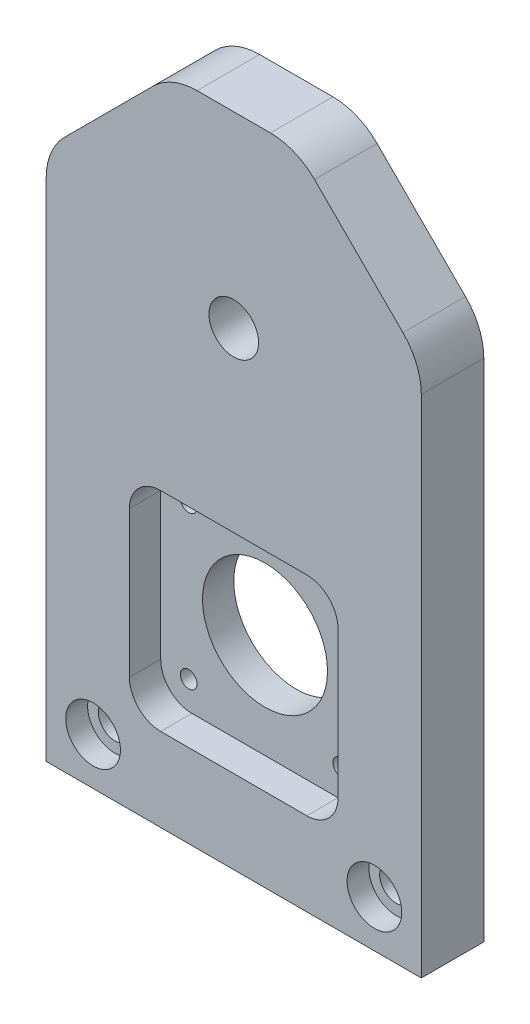
ISO-10303-21;
HEADER;
FILE_DESCRIPTION(('STEP AP214'),'2;1');
FILE_NAME('part.step','',(''),(''),'','','');
FILE_SCHEMA(('AUTOMOTIVE_DESIGN { 1 0 10303 214 1 1 1 1 }'));
ENDSEC;
DATA;
#1=APPLICATION_CONTEXT('core data for automotive mechanical design processes');
#2=APPLICATION_PROTOCOL_DEFINITION('international standard','automotive_design',2000,#1);
#3=PRODUCT_CONTEXT('',#1,'mechanical');
#4=PRODUCT('Part','Part','',(#3));
#5=PRODUCT_RELATED_PRODUCT_CATEGORY('part','',(#4));
#6=PRODUCT_DEFINITION_FORMATION('','',#4);
#7=PRODUCT_DEFINITION_CONTEXT('part definition',#1,'design');
#8=PRODUCT_DEFINITION('design','',#6,#7);
#9=PRODUCT_DEFINITION_SHAPE('','',#8);
#10=(LENGTH_UNIT() NAMED_UNIT(*) SI_UNIT(.MILLI.,.METRE.));
#11=(NAMED_UNIT(*) PLANE_ANGLE_UNIT() SI_UNIT($,.RADIAN.));
#12=(NAMED_UNIT(*) SI_UNIT($,.STERADIAN.) SOLID_ANGLE_UNIT());
#13=UNCERTAINTY_MEASURE_WITH_UNIT(LENGTH_MEASURE(1.E-05),#10,'distance_accuracy_value','');
#14=(GEOMETRIC_REPRESENTATION_CONTEXT(3) GLOBAL_UNCERTAINTY_ASSIGNED_CONTEXT((#13)) GLOBAL_UNIT_ASSIGNED_CONTEXT((#10,
#11,#12)) REPRESENTATION_CONTEXT('',''));
#15=CARTESIAN_POINT('',(0.,0.,0.));
#16=DIRECTION('',(0.,0.,1.));
#17=DIRECTION('',(1.,0.,0.));
#18=AXIS2_PLACEMENT_3D('',#15,#16,#17);
#19=CARTESIAN_POINT('',(38.1,-95.25,6.35));
#20=DIRECTION('',(-1.,0.,0.));
#21=DIRECTION('',(0.,-1.,0.));
#22=AXIS2_PLACEMENT_3D('',#19,#20,#21);
#23=PLANE('',#22);
#24=DIRECTION('',(0.,1.,0.));
#25=VECTOR('',#24,1.);
#26=CARTESIAN_POINT('',(38.1,-95.25,-6.35));
#27=LINE('',#26,#25);
#28=CARTESIAN_POINT('',(38.1,-95.25,-6.35));
#29=VERTEX_POINT('',#28);
#30=CARTESIAN_POINT('',(38.1,7.4394877578616,-6.35));
#31=VERTEX_POINT('',#30);
#32=EDGE_CURVE('E202',#29,#31,#27,.T.);
#33=ORIENTED_EDGE('',*,*,#32,.T.);
#34=DIRECTION('',(0.,0.,-1.));
#35=VECTOR('',#34,1.);
#36=CARTESIAN_POINT('',(38.1,7.4394877578616,6.35));
#37=LINE('',#36,#35);
#38=CARTESIAN_POINT('',(38.1,7.4394877578616,6.35));
#39=VERTEX_POINT('',#38);
#40=EDGE_CURVE('E288',#31,#39,#37,.F.);
#41=ORIENTED_EDGE('',*,*,#40,.T.);
#42=DIRECTION('',(0.,1.,0.));
#43=VECTOR('',#42,1.);
#44=CARTESIAN_POINT('',(38.1,-95.25,6.35));
#45=LINE('',#44,#43);
#46=CARTESIAN_POINT('',(38.1,-95.25,6.35));
#47=VERTEX_POINT('',#46);
#48=EDGE_CURVE('E215',#47,#39,#45,.T.);
#49=ORIENTED_EDGE('',*,*,#48,.F.);
#50=DIRECTION('',(0.,0.,-1.));
#51=VECTOR('',#50,1.);
#52=CARTESIAN_POINT('',(38.1,-95.25,6.35));
#53=LINE('',#52,#51);
#54=EDGE_CURVE('E191',#47,#29,#53,.T.);
#55=ORIENTED_EDGE('',*,*,#54,.T.);
#56=EDGE_LOOP('',(#33,#41,#49,#55));
#57=FACE_BOUND('',#56,.T.);
#58=ADVANCED_FACE('F43',(#57),#23,.F.);
#59=CARTESIAN_POINT('',(-38.1,38.1,6.35));
#60=DIRECTION('',(0.,-1.,0.));
#61=DIRECTION('',(0.,0.,-1.));
#62=AXIS2_PLACEMENT_3D('',#59,#60,#61);
#63=PLANE('',#62);
#64=DIRECTION('',(-1.,0.,0.));
#65=VECTOR('',#64,1.);
#66=CARTESIAN_POINT('',(-38.1,38.1,6.35));
#67=LINE('',#66,#65);
#68=CARTESIAN_POINT('',(7.43948775786166,38.1,6.35));
#69=VERTEX_POINT('',#68);
#70=CARTESIAN_POINT('',(-7.4394877578616,38.1,6.35));
#71=VERTEX_POINT('',#70);
#72=EDGE_CURVE('E181',#69,#71,#67,.T.);
#73=ORIENTED_EDGE('',*,*,#72,.F.);
#74=DIRECTION('',(0.,0.,1.));
#75=VECTOR('',#74,1.);
#76=CARTESIAN_POINT('',(7.43948775786166,38.1,-6.35));
#77=LINE('',#76,#75);
#78=CARTESIAN_POINT('',(7.43948775786166,38.1,-6.35));
#79=VERTEX_POINT('',#78);
#80=EDGE_CURVE('E324',#69,#79,#77,.F.);
#81=ORIENTED_EDGE('',*,*,#80,.T.);
#82=DIRECTION('',(-1.,0.,0.));
#83=VECTOR('',#82,1.);
#84=CARTESIAN_POINT('',(-38.1,38.1,-6.35));
#85=LINE('',#84,#83);
#86=CARTESIAN_POINT('',(-7.4394877578616,38.1,-6.35));
#87=VERTEX_POINT('',#86);
#88=EDGE_CURVE('E206',#79,#87,#85,.T.);
#89=ORIENTED_EDGE('',*,*,#88,.T.);
#90=DIRECTION('',(0.,0.,-1.));
#91=VECTOR('',#90,1.);
#92=CARTESIAN_POINT('',(-7.4394877578616,38.1,6.35));
#93=LINE('',#92,#91);
#94=EDGE_CURVE('E320',#87,#71,#93,.F.);
#95=ORIENTED_EDGE('',*,*,#94,.T.);
#96=EDGE_LOOP('',(#73,#81,#89,#95));
#97=FACE_BOUND('',#96,.T.);
#98=ADVANCED_FACE('F517',(#97),#63,.F.);
#99=CARTESIAN_POINT('',(-38.1,-95.25,6.35));
#100=DIRECTION('',(1.,0.,0.));
#101=DIRECTION('',(0.,0.,-1.));
#102=AXIS2_PLACEMENT_3D('',#99,#100,#101);
#103=PLANE('',#102);
#104=DIRECTION('',(0.,-1.,0.));
#105=VECTOR('',#104,1.);
#106=CARTESIAN_POINT('',(-38.1,-95.25,6.35));
#107=LINE('',#106,#105);
#108=CARTESIAN_POINT('',(-38.1,7.43948775786167,6.35));
#109=VERTEX_POINT('',#108);
#110=CARTESIAN_POINT('',(-38.1,-95.25,6.35));
#111=VERTEX_POINT('',#110);
#112=EDGE_CURVE('E168',#109,#111,#107,.T.);
#113=ORIENTED_EDGE('',*,*,#112,.F.);
#114=DIRECTION('',(0.,0.,1.));
#115=VECTOR('',#114,1.);
#116=CARTESIAN_POINT('',(-38.1,7.43948775786167,-6.35));
#117=LINE('',#116,#115);
#118=CARTESIAN_POINT('',(-38.1,7.43948775786167,-6.35));
#119=VERTEX_POINT('',#118);
#120=EDGE_CURVE('E12',#109,#119,#117,.F.);
#121=ORIENTED_EDGE('',*,*,#120,.T.);
#122=DIRECTION('',(0.,-1.,0.));
#123=VECTOR('',#122,1.);
#124=CARTESIAN_POINT('',(-38.1,-95.25,-6.35));
#125=LINE('',#124,#123);
#126=CARTESIAN_POINT('',(-38.1,-95.25,-6.35));
#127=VERTEX_POINT('',#126);
#128=EDGE_CURVE('E186',#119,#127,#125,.T.);
#129=ORIENTED_EDGE('',*,*,#128,.T.);
#130=DIRECTION('',(0.,0.,-1.));
#131=VECTOR('',#130,1.);
#132=CARTESIAN_POINT('',(-38.1,-95.25,6.35));
#133=LINE('',#132,#131);
#134=EDGE_CURVE('E184',#111,#127,#133,.T.);
#135=ORIENTED_EDGE('',*,*,#134,.F.);
#136=EDGE_LOOP('',(#113,#121,#129,#135));
#137=FACE_BOUND('',#136,.T.);
#138=ADVANCED_FACE('F185',(#137),#103,.F.);
#139=CARTESIAN_POINT('',(-38.1,-95.25,6.35));
#140=DIRECTION('',(0.,1.,0.));
#141=DIRECTION('',(0.,0.,1.));
#142=AXIS2_PLACEMENT_3D('',#139,#140,#141);
#143=PLANE('',#142);
#144=DIRECTION('',(1.,0.,0.));
#145=VECTOR('',#144,1.);
#146=CARTESIAN_POINT('',(-38.1,-95.25,-6.35));
#147=LINE('',#146,#145);
#148=EDGE_CURVE('E213',#127,#29,#147,.T.);
#149=ORIENTED_EDGE('',*,*,#148,.T.);
#150=ORIENTED_EDGE('',*,*,#54,.F.);
#151=DIRECTION('',(1.,0.,0.));
#152=VECTOR('',#151,1.);
#153=CARTESIAN_POINT('',(-38.1,-95.25,6.35));
#154=LINE('',#153,#152);
#155=EDGE_CURVE('E173',#111,#47,#154,.T.);
#156=ORIENTED_EDGE('',*,*,#155,.F.);
#157=ORIENTED_EDGE('',*,*,#134,.T.);
#158=EDGE_LOOP('',(#149,#150,#156,#157));
#159=FACE_BOUND('',#158,.T.);
#160=ADVANCED_FACE('F193',(#159),#143,.F.);
#161=CARTESIAN_POINT('',(0.,0.,6.35));
#162=DIRECTION('',(0.,0.,-1.));
#163=DIRECTION('',(-1.,0.,0.));
#164=AXIS2_PLACEMENT_3D('',#161,#162,#163);
#165=PLANE('',#164);
#166=CARTESIAN_POINT('',(-28.575,-85.725,6.35));
#167=DIRECTION('',(0.,0.,1.));
#168=DIRECTION('',(1.,0.,0.));
#169=AXIS2_PLACEMENT_3D('',#166,#167,#168);
#170=CIRCLE('',#169,5.55625);
#171=CARTESIAN_POINT('',(-23.01875,-85.725,6.35));
#172=VERTEX_POINT('',#171);
#173=EDGE_CURVE('E428',#172,#172,#170,.T.);
#174=ORIENTED_EDGE('',*,*,#173,.F.);
#175=EDGE_LOOP('',(#174));
#176=FACE_BOUND('',#175,.T.);
#177=CARTESIAN_POINT('',(28.575,-85.725,6.35));
#178=DIRECTION('',(0.,0.,1.));
#179=DIRECTION('',(1.,0.,0.));
#180=AXIS2_PLACEMENT_3D('',#177,#178,#179);
#181=CIRCLE('',#180,5.55625);
#182=CARTESIAN_POINT('',(34.13125,-85.725,6.35));
#183=VERTEX_POINT('',#182);
#184=EDGE_CURVE('E412',#183,#183,#181,.T.);
#185=ORIENTED_EDGE('',*,*,#184,.F.);
#186=EDGE_LOOP('',(#185));
#187=FACE_BOUND('',#186,.T.);
#188=DIRECTION('',(0.,-1.,0.));
#189=VECTOR('',#188,1.);
#190=CARTESIAN_POINT('',(-21.190500037,-78.340500037,6.35));
#191=LINE('',#190,#189);
#192=CARTESIAN_POINT('',(-21.190500037,-42.309499963,6.35));
#193=VERTEX_POINT('',#192);
#194=CARTESIAN_POINT('',(-21.190500037,-71.990500037,6.35));
#195=VERTEX_POINT('',#194);
#196=EDGE_CURVE('E394',#193,#195,#191,.T.);
#197=ORIENTED_EDGE('',*,*,#196,.F.);
#198=CARTESIAN_POINT('',(-14.840500037,-42.309499963,6.34999999999999));
#199=DIRECTION('',(0.,0.,-1.));
#200=DIRECTION('',(-1.,0.,0.));
#201=AXIS2_PLACEMENT_3D('',#198,#199,#200);
#202=CIRCLE('',#201,6.35);
#203=CARTESIAN_POINT('',(-14.840500037,-35.959499963,6.35));
#204=VERTEX_POINT('',#203);
#205=EDGE_CURVE('E279',#193,#204,#202,.T.);
#206=ORIENTED_EDGE('',*,*,#205,.T.);
#207=DIRECTION('',(-1.,0.,0.));
#208=VECTOR('',#207,1.);
#209=CARTESIAN_POINT('',(-21.190500037,-35.959499963,6.35));
#210=LINE('',#209,#208);
#211=CARTESIAN_POINT('',(14.840500037,-35.959499963,6.35));
#212=VERTEX_POINT('',#211);
#213=EDGE_CURVE('E389',#212,#204,#210,.T.);
#214=ORIENTED_EDGE('',*,*,#213,.F.);
#215=CARTESIAN_POINT('',(14.840500037,-42.309499963,6.34999999999999));
#216=DIRECTION('',(0.,0.,-1.));
#217=DIRECTION('',(-1.,0.,0.));
#218=AXIS2_PLACEMENT_3D('',#215,#216,#217);
#219=CIRCLE('',#218,6.35);
#220=CARTESIAN_POINT('',(21.190500037,-42.309499963,6.35));
#221=VERTEX_POINT('',#220);
#222=EDGE_CURVE('E282',#212,#221,#219,.T.);
#223=ORIENTED_EDGE('',*,*,#222,.T.);
#224=DIRECTION('',(0.,1.,0.));
#225=VECTOR('',#224,1.);
#226=CARTESIAN_POINT('',(21.190500037,-78.340500037,6.35));
#227=LINE('',#226,#225);
#228=CARTESIAN_POINT('',(21.190500037,-71.990500037,6.35));
#229=VERTEX_POINT('',#228);
#230=EDGE_CURVE('E385',#229,#221,#227,.T.);
#231=ORIENTED_EDGE('',*,*,#230,.F.);
#232=CARTESIAN_POINT('',(14.840500037,-71.990500037,6.34999999999999));
#233=DIRECTION('',(0.,0.,-1.));
#234=DIRECTION('',(-1.,0.,0.));
#235=AXIS2_PLACEMENT_3D('',#232,#233,#234);
#236=CIRCLE('',#235,6.35);
#237=CARTESIAN_POINT('',(14.840500037,-78.340500037,6.35));
#238=VERTEX_POINT('',#237);
#239=EDGE_CURVE('E276',#229,#238,#236,.T.);
#240=ORIENTED_EDGE('',*,*,#239,.T.);
#241=DIRECTION('',(1.,0.,0.));
#242=VECTOR('',#241,1.);
#243=CARTESIAN_POINT('',(-21.190500037,-78.340500037,6.35));
#244=LINE('',#243,#242);
#245=CARTESIAN_POINT('',(-14.840500037,-78.340500037,6.35));
#246=VERTEX_POINT('',#245);
#247=EDGE_CURVE('E384',#246,#238,#244,.T.);
#248=ORIENTED_EDGE('',*,*,#247,.F.);
#249=CARTESIAN_POINT('',(-14.840500037,-71.990500037,6.34999999999999));
#250=DIRECTION('',(0.,0.,-1.));
#251=DIRECTION('',(-1.,0.,0.));
#252=AXIS2_PLACEMENT_3D('',#249,#250,#251);
#253=CIRCLE('',#252,6.35);
#254=EDGE_CURVE('E285',#246,#195,#253,.T.);
#255=ORIENTED_EDGE('',*,*,#254,.T.);
#256=EDGE_LOOP('',(#197,#206,#214,#223,#231,#240,#248,#255));
#257=FACE_BOUND('',#256,.T.);
#258=CARTESIAN_POINT('',(0.,0.,6.35));
#259=DIRECTION('',(0.,0.,1.));
#260=DIRECTION('',(1.,0.,0.));
#261=AXIS2_PLACEMENT_3D('',#258,#259,#260);
#262=CIRCLE('',#261,5.0419);
#263=CARTESIAN_POINT('',(5.0419,0.,6.35));
#264=VERTEX_POINT('',#263);
#265=EDGE_CURVE('E346',#264,#264,#262,.T.);
#266=ORIENTED_EDGE('',*,*,#265,.F.);
#267=EDGE_LOOP('',(#266));
#268=FACE_BOUND('',#267,.T.);
#269=ORIENTED_EDGE('',*,*,#48,.T.);
#270=CARTESIAN_POINT('',(25.4,7.4394877578616,6.35));
#271=DIRECTION('',(0.,0.,-1.));
#272=DIRECTION('',(-1.,0.,0.));
#273=AXIS2_PLACEMENT_3D('',#270,#271,#272);
#274=CIRCLE('',#273,12.7);
#275=CARTESIAN_POINT('',(34.3802561210692,16.4197438789307,6.35));
#276=VERTEX_POINT('',#275);
#277=EDGE_CURVE('E300',#39,#276,#274,.F.);
#278=ORIENTED_EDGE('',*,*,#277,.T.);
#279=DIRECTION('',(0.707106781186546,-0.707106781186549,0.));
#280=VECTOR('',#279,1.);
#281=CARTESIAN_POINT('',(12.7,38.1,6.35));
#282=LINE('',#281,#280);
#283=CARTESIAN_POINT('',(16.4197438789308,34.3802561210692,6.35));
#284=VERTEX_POINT('',#283);
#285=EDGE_CURVE('E232',#276,#284,#282,.F.);
#286=ORIENTED_EDGE('',*,*,#285,.T.);
#287=CARTESIAN_POINT('',(7.43948775786166,25.4,6.35));
#288=DIRECTION('',(0.,0.,-1.));
#289=DIRECTION('',(-1.,0.,0.));
#290=AXIS2_PLACEMENT_3D('',#287,#288,#289);
#291=CIRCLE('',#290,12.7);
#292=EDGE_CURVE('E297',#284,#69,#291,.F.);
#293=ORIENTED_EDGE('',*,*,#292,.T.);
#294=ORIENTED_EDGE('',*,*,#72,.T.);
#295=CARTESIAN_POINT('',(-7.4394877578616,25.4,6.35));
#296=DIRECTION('',(0.,0.,-1.));
#297=DIRECTION('',(-1.,0.,0.));
#298=AXIS2_PLACEMENT_3D('',#295,#296,#297);
#299=CIRCLE('',#298,12.7);
#300=CARTESIAN_POINT('',(-16.4197438789307,34.3802561210692,6.35));
#301=VERTEX_POINT('',#300);
#302=EDGE_CURVE('E294',#71,#301,#299,.F.);
#303=ORIENTED_EDGE('',*,*,#302,.T.);
#304=DIRECTION('',(0.707106781186549,0.707106781186546,0.));
#305=VECTOR('',#304,1.);
#306=CARTESIAN_POINT('',(-38.1,12.7,6.35));
#307=LINE('',#306,#305);
#308=CARTESIAN_POINT('',(-34.3802561210691,16.4197438789308,6.35));
#309=VERTEX_POINT('',#308);
#310=EDGE_CURVE('E229',#301,#309,#307,.F.);
#311=ORIENTED_EDGE('',*,*,#310,.T.);
#312=CARTESIAN_POINT('',(-25.4,7.43948775786167,6.35));
#313=DIRECTION('',(0.,0.,-1.));
#314=DIRECTION('',(-1.,0.,0.));
#315=AXIS2_PLACEMENT_3D('',#312,#313,#314);
#316=CIRCLE('',#315,12.7);
#317=EDGE_CURVE('E177',#309,#109,#316,.F.);
#318=ORIENTED_EDGE('',*,*,#317,.T.);
#319=ORIENTED_EDGE('',*,*,#112,.T.);
#320=ORIENTED_EDGE('',*,*,#155,.T.);
#321=EDGE_LOOP('',(#269,#278,#286,#293,#294,#303,#311,#318,#319,#320));
#322=FACE_BOUND('',#321,.T.);
#323=ADVANCED_FACE('F171',(#176,#187,#257,#268,#322),#165,.F.);
#324=CARTESIAN_POINT('',(0.,0.,-6.35));
#325=DIRECTION('',(0.,0.,-1.));
#326=DIRECTION('',(-1.,0.,0.));
#327=AXIS2_PLACEMENT_3D('',#324,#325,#326);
#328=PLANE('',#327);
#329=CARTESIAN_POINT('',(15.5,-41.65,-6.35));
#330=DIRECTION('',(0.,0.,-1.));
#331=DIRECTION('',(-1.,0.,0.));
#332=AXIS2_PLACEMENT_3D('',#329,#330,#331);
#333=CIRCLE('',#332,3.25);
#334=CARTESIAN_POINT('',(12.25,-41.65,-6.35));
#335=VERTEX_POINT('',#334);
#336=EDGE_CURVE('E476',#335,#335,#333,.T.);
#337=ORIENTED_EDGE('',*,*,#336,.F.);
#338=EDGE_LOOP('',(#337));
#339=FACE_BOUND('',#338,.T.);
#340=CARTESIAN_POINT('',(-15.5,-41.65,-6.35));
#341=DIRECTION('',(0.,0.,-1.));
#342=DIRECTION('',(-1.,0.,0.));
#343=AXIS2_PLACEMENT_3D('',#340,#341,#342);
#344=CIRCLE('',#343,3.25);
#345=CARTESIAN_POINT('',(-18.75,-41.65,-6.35));
#346=VERTEX_POINT('',#345);
#347=EDGE_CURVE('E464',#346,#346,#344,.T.);
#348=ORIENTED_EDGE('',*,*,#347,.F.);
#349=EDGE_LOOP('',(#348));
#350=FACE_BOUND('',#349,.T.);
#351=CARTESIAN_POINT('',(-15.5,-72.65,-6.35));
#352=DIRECTION('',(0.,0.,-1.));
#353=DIRECTION('',(-1.,0.,0.));
#354=AXIS2_PLACEMENT_3D('',#351,#352,#353);
#355=CIRCLE('',#354,3.25);
#356=CARTESIAN_POINT('',(-18.75,-72.65,-6.35));
#357=VERTEX_POINT('',#356);
#358=EDGE_CURVE('E452',#357,#357,#355,.T.);
#359=ORIENTED_EDGE('',*,*,#358,.F.);
#360=EDGE_LOOP('',(#359));
#361=FACE_BOUND('',#360,.T.);
#362=CARTESIAN_POINT('',(15.5,-72.65,-6.35));
#363=DIRECTION('',(0.,0.,-1.));
#364=DIRECTION('',(-1.,0.,0.));
#365=AXIS2_PLACEMENT_3D('',#362,#363,#364);
#366=CIRCLE('',#365,3.25);
#367=CARTESIAN_POINT('',(12.25,-72.65,-6.35));
#368=VERTEX_POINT('',#367);
#369=EDGE_CURVE('E440',#368,#368,#366,.T.);
#370=ORIENTED_EDGE('',*,*,#369,.F.);
#371=EDGE_LOOP('',(#370));
#372=FACE_BOUND('',#371,.T.);
#373=CARTESIAN_POINT('',(-28.575,-85.725,-6.35));
#374=DIRECTION('',(0.,0.,1.));
#375=DIRECTION('',(1.,0.,0.));
#376=AXIS2_PLACEMENT_3D('',#373,#374,#375);
#377=CIRCLE('',#376,3.3782);
#378=CARTESIAN_POINT('',(-25.1968,-85.725,-6.35));
#379=VERTEX_POINT('',#378);
#380=EDGE_CURVE('E416',#379,#379,#377,.T.);
#381=ORIENTED_EDGE('',*,*,#380,.T.);
#382=EDGE_LOOP('',(#381));
#383=FACE_BOUND('',#382,.T.);
#384=CARTESIAN_POINT('',(28.575,-85.725,-6.35));
#385=DIRECTION('',(0.,0.,1.));
#386=DIRECTION('',(1.,0.,0.));
#387=AXIS2_PLACEMENT_3D('',#384,#385,#386);
#388=CIRCLE('',#387,3.3782);
#389=CARTESIAN_POINT('',(31.9532,-85.725,-6.35));
#390=VERTEX_POINT('',#389);
#391=EDGE_CURVE('E390',#390,#390,#388,.T.);
#392=ORIENTED_EDGE('',*,*,#391,.T.);
#393=EDGE_LOOP('',(#392));
#394=FACE_BOUND('',#393,.T.);
#395=CARTESIAN_POINT('',(0.,-57.15,-6.35));
#396=DIRECTION('',(0.,0.,1.));
#397=DIRECTION('',(1.,0.,0.));
#398=AXIS2_PLACEMENT_3D('',#395,#396,#397);
#399=CIRCLE('',#398,12.7);
#400=CARTESIAN_POINT('',(12.7,-57.15,-6.35));
#401=VERTEX_POINT('',#400);
#402=EDGE_CURVE('E350',#401,#401,#399,.T.);
#403=ORIENTED_EDGE('',*,*,#402,.T.);
#404=EDGE_LOOP('',(#403));
#405=FACE_BOUND('',#404,.T.);
#406=CARTESIAN_POINT('',(0.,0.,-6.35));
#407=DIRECTION('',(0.,0.,1.));
#408=DIRECTION('',(1.,0.,0.));
#409=AXIS2_PLACEMENT_3D('',#406,#407,#408);
#410=CIRCLE('',#409,5.0419);
#411=CARTESIAN_POINT('',(5.0419,0.,-6.35));
#412=VERTEX_POINT('',#411);
#413=EDGE_CURVE('E207',#412,#412,#410,.T.);
#414=ORIENTED_EDGE('',*,*,#413,.T.);
#415=EDGE_LOOP('',(#414));
#416=FACE_BOUND('',#415,.T.);
#417=DIRECTION('',(-0.707106781186546,0.707106781186549,0.));
#418=VECTOR('',#417,1.);
#419=CARTESIAN_POINT('',(25.4,25.3999999999999,-6.35));
#420=LINE('',#419,#418);
#421=CARTESIAN_POINT('',(16.4197438789308,34.3802561210691,-6.35));
#422=VERTEX_POINT('',#421);
#423=CARTESIAN_POINT('',(34.3802561210692,16.4197438789307,-6.35));
#424=VERTEX_POINT('',#423);
#425=EDGE_CURVE('E225',#422,#424,#420,.F.);
#426=ORIENTED_EDGE('',*,*,#425,.T.);
#427=CARTESIAN_POINT('',(25.4,7.4394877578616,-6.35));
#428=DIRECTION('',(0.,0.,-1.));
#429=DIRECTION('',(-1.,0.,0.));
#430=AXIS2_PLACEMENT_3D('',#427,#428,#429);
#431=CIRCLE('',#430,12.7);
#432=EDGE_CURVE('E317',#424,#31,#431,.T.);
#433=ORIENTED_EDGE('',*,*,#432,.T.);
#434=ORIENTED_EDGE('',*,*,#32,.F.);
#435=ORIENTED_EDGE('',*,*,#148,.F.);
#436=ORIENTED_EDGE('',*,*,#128,.F.);
#437=CARTESIAN_POINT('',(-25.4,7.43948775786167,-6.35));
#438=DIRECTION('',(0.,0.,-1.));
#439=DIRECTION('',(-1.,0.,0.));
#440=AXIS2_PLACEMENT_3D('',#437,#438,#439);
#441=CIRCLE('',#440,12.7);
#442=CARTESIAN_POINT('',(-34.3802561210691,16.4197438789308,-6.35));
#443=VERTEX_POINT('',#442);
#444=EDGE_CURVE('E65',#119,#443,#441,.T.);
#445=ORIENTED_EDGE('',*,*,#444,.T.);
#446=DIRECTION('',(-0.707106781186549,-0.707106781186546,0.));
#447=VECTOR('',#446,1.);
#448=CARTESIAN_POINT('',(-25.3999999999999,25.4,-6.35));
#449=LINE('',#448,#447);
#450=CARTESIAN_POINT('',(-16.4197438789307,34.3802561210692,-6.35));
#451=VERTEX_POINT('',#450);
#452=EDGE_CURVE('E190',#443,#451,#449,.F.);
#453=ORIENTED_EDGE('',*,*,#452,.T.);
#454=CARTESIAN_POINT('',(-7.4394877578616,25.4,-6.35));
#455=DIRECTION('',(0.,0.,-1.));
#456=DIRECTION('',(-1.,0.,0.));
#457=AXIS2_PLACEMENT_3D('',#454,#455,#456);
#458=CIRCLE('',#457,12.7);
#459=EDGE_CURVE('E311',#451,#87,#458,.T.);
#460=ORIENTED_EDGE('',*,*,#459,.T.);
#461=ORIENTED_EDGE('',*,*,#88,.F.);
#462=CARTESIAN_POINT('',(7.43948775786166,25.4,-6.35));
#463=DIRECTION('',(0.,0.,-1.));
#464=DIRECTION('',(-1.,0.,0.));
#465=AXIS2_PLACEMENT_3D('',#462,#463,#464);
#466=CIRCLE('',#465,12.7);
#467=EDGE_CURVE('E314',#79,#422,#466,.T.);
#468=ORIENTED_EDGE('',*,*,#467,.T.);
#469=EDGE_LOOP('',(#426,#433,#434,#435,#436,#445,#453,#460,#461,#468));
#470=FACE_BOUND('',#469,.T.);
#471=ADVANCED_FACE('F335',(#339,#350,#361,#372,#383,#394,#405,#416,#470),#328,.T.);
#472=CARTESIAN_POINT('',(0.,0.,6.35));
#473=DIRECTION('',(0.,0.,1.));
#474=DIRECTION('',(1.,0.,0.));
#475=AXIS2_PLACEMENT_3D('',#472,#473,#474);
#476=CYLINDRICAL_SURFACE('',#475,5.0419);
#477=ORIENTED_EDGE('',*,*,#413,.F.);
#478=EDGE_LOOP('',(#477));
#479=FACE_BOUND('',#478,.T.);
#480=ORIENTED_EDGE('',*,*,#265,.T.);
#481=EDGE_LOOP('',(#480));
#482=FACE_BOUND('',#481,.T.);
#483=ADVANCED_FACE('F485',(#479,#482),#476,.F.);
#484=CARTESIAN_POINT('',(-15.5,-72.65,6.35));
#485=DIRECTION('',(0.,0.,1.));
#486=DIRECTION('',(1.,0.,0.));
#487=AXIS2_PLACEMENT_3D('',#484,#485,#486);
#488=CYLINDRICAL_SURFACE('',#487,1.7);
#489=CARTESIAN_POINT('',(-15.5,-72.65,-3.35));
#490=DIRECTION('',(0.,0.,-1.));
#491=DIRECTION('',(-1.,0.,0.));
#492=AXIS2_PLACEMENT_3D('',#489,#490,#491);
#493=CIRCLE('',#492,1.7);
#494=CARTESIAN_POINT('',(-17.2,-72.65,-3.35));
#495=VERTEX_POINT('',#494);
#496=EDGE_CURVE('E444',#495,#495,#493,.T.);
#497=ORIENTED_EDGE('',*,*,#496,.T.);
#498=EDGE_LOOP('',(#497));
#499=FACE_BOUND('',#498,.T.);
#500=CARTESIAN_POINT('',(-15.5,-72.65,0.));
#501=DIRECTION('',(0.,0.,-1.));
#502=DIRECTION('',(-1.,0.,0.));
#503=AXIS2_PLACEMENT_3D('',#500,#501,#502);
#504=CIRCLE('',#503,1.7);
#505=CARTESIAN_POINT('',(-17.2,-72.65,0.));
#506=VERTEX_POINT('',#505);
#507=EDGE_CURVE('E354',#506,#506,#504,.F.);
#508=ORIENTED_EDGE('',*,*,#507,.T.);
#509=EDGE_LOOP('',(#508));
#510=FACE_BOUND('',#509,.T.);
#511=ADVANCED_FACE('F503',(#499,#510),#488,.F.);
#512=CARTESIAN_POINT('',(15.5,-72.65,6.35));
#513=DIRECTION('',(0.,0.,1.));
#514=DIRECTION('',(1.,0.,0.));
#515=AXIS2_PLACEMENT_3D('',#512,#513,#514);
#516=CYLINDRICAL_SURFACE('',#515,1.7);
#517=CARTESIAN_POINT('',(15.5,-72.65,-3.35));
#518=DIRECTION('',(0.,0.,-1.));
#519=DIRECTION('',(-1.,0.,0.));
#520=AXIS2_PLACEMENT_3D('',#517,#518,#519);
#521=CIRCLE('',#520,1.7);
#522=CARTESIAN_POINT('',(13.8,-72.65,-3.35));
#523=VERTEX_POINT('',#522);
#524=EDGE_CURVE('E432',#523,#523,#521,.T.);
#525=ORIENTED_EDGE('',*,*,#524,.T.);
#526=EDGE_LOOP('',(#525));
#527=FACE_BOUND('',#526,.T.);
#528=CARTESIAN_POINT('',(15.5,-72.65,0.));
#529=DIRECTION('',(0.,0.,-1.));
#530=DIRECTION('',(-1.,0.,0.));
#531=AXIS2_PLACEMENT_3D('',#528,#529,#530);
#532=CIRCLE('',#531,1.7);
#533=CARTESIAN_POINT('',(13.8,-72.65,0.));
#534=VERTEX_POINT('',#533);
#535=EDGE_CURVE('E358',#534,#534,#532,.F.);
#536=ORIENTED_EDGE('',*,*,#535,.T.);
#537=EDGE_LOOP('',(#536));
#538=FACE_BOUND('',#537,.T.);
#539=ADVANCED_FACE('F819',(#527,#538),#516,.F.);
#540=CARTESIAN_POINT('',(15.5,-41.65,6.35));
#541=DIRECTION('',(0.,0.,1.));
#542=DIRECTION('',(1.,0.,0.));
#543=AXIS2_PLACEMENT_3D('',#540,#541,#542);
#544=CYLINDRICAL_SURFACE('',#543,1.7);
#545=CARTESIAN_POINT('',(15.5,-41.65,-3.35));
#546=DIRECTION('',(0.,0.,-1.));
#547=DIRECTION('',(-1.,0.,0.));
#548=AXIS2_PLACEMENT_3D('',#545,#546,#547);
#549=CIRCLE('',#548,1.7);
#550=CARTESIAN_POINT('',(13.8,-41.65,-3.35));
#551=VERTEX_POINT('',#550);
#552=EDGE_CURVE('E468',#551,#551,#549,.T.);
#553=ORIENTED_EDGE('',*,*,#552,.T.);
#554=EDGE_LOOP('',(#553));
#555=FACE_BOUND('',#554,.T.);
#556=CARTESIAN_POINT('',(15.5,-41.65,0.));
#557=DIRECTION('',(0.,0.,-1.));
#558=DIRECTION('',(-1.,0.,0.));
#559=AXIS2_PLACEMENT_3D('',#556,#557,#558);
#560=CIRCLE('',#559,1.7);
#561=CARTESIAN_POINT('',(13.8,-41.65,0.));
#562=VERTEX_POINT('',#561);
#563=EDGE_CURVE('E362',#562,#562,#560,.F.);
#564=ORIENTED_EDGE('',*,*,#563,.T.);
#565=EDGE_LOOP('',(#564));
#566=FACE_BOUND('',#565,.T.);
#567=ADVANCED_FACE('F809',(#555,#566),#544,.F.);
#568=CARTESIAN_POINT('',(-15.5,-41.65,6.35));
#569=DIRECTION('',(0.,0.,1.));
#570=DIRECTION('',(1.,0.,0.));
#571=AXIS2_PLACEMENT_3D('',#568,#569,#570);
#572=CYLINDRICAL_SURFACE('',#571,1.7);
#573=CARTESIAN_POINT('',(-15.5,-41.65,-3.35));
#574=DIRECTION('',(0.,0.,-1.));
#575=DIRECTION('',(-1.,0.,0.));
#576=AXIS2_PLACEMENT_3D('',#573,#574,#575);
#577=CIRCLE('',#576,1.7);
#578=CARTESIAN_POINT('',(-17.2,-41.65,-3.35));
#579=VERTEX_POINT('',#578);
#580=EDGE_CURVE('E456',#579,#579,#577,.T.);
#581=ORIENTED_EDGE('',*,*,#580,.T.);
#582=EDGE_LOOP('',(#581));
#583=FACE_BOUND('',#582,.T.);
#584=CARTESIAN_POINT('',(-15.5,-41.65,0.));
#585=DIRECTION('',(0.,0.,-1.));
#586=DIRECTION('',(-1.,0.,0.));
#587=AXIS2_PLACEMENT_3D('',#584,#585,#586);
#588=CIRCLE('',#587,1.7);
#589=CARTESIAN_POINT('',(-17.2,-41.65,0.));
#590=VERTEX_POINT('',#589);
#591=EDGE_CURVE('E221',#590,#590,#588,.F.);
#592=ORIENTED_EDGE('',*,*,#591,.T.);
#593=EDGE_LOOP('',(#592));
#594=FACE_BOUND('',#593,.T.);
#595=ADVANCED_FACE('F804',(#583,#594),#572,.F.);
#596=CARTESIAN_POINT('',(0.,-57.15,-6.35));
#597=DIRECTION('',(0.,0.,1.));
#598=DIRECTION('',(1.,0.,0.));
#599=AXIS2_PLACEMENT_3D('',#596,#597,#598);
#600=CYLINDRICAL_SURFACE('',#599,12.7);
#601=CARTESIAN_POINT('',(0.,-57.15,0.));
#602=DIRECTION('',(0.,0.,-1.));
#603=DIRECTION('',(-1.,0.,0.));
#604=AXIS2_PLACEMENT_3D('',#601,#602,#603);
#605=CIRCLE('',#604,12.7);
#606=CARTESIAN_POINT('',(-12.7,-57.15,0.));
#607=VERTEX_POINT('',#606);
#608=EDGE_CURVE('E217',#607,#607,#605,.F.);
#609=ORIENTED_EDGE('',*,*,#608,.T.);
#610=EDGE_LOOP('',(#609));
#611=FACE_BOUND('',#610,.T.);
#612=ORIENTED_EDGE('',*,*,#402,.F.);
#613=EDGE_LOOP('',(#612));
#614=FACE_BOUND('',#613,.T.);
#615=ADVANCED_FACE('F716',(#611,#614),#600,.F.);
#616=CARTESIAN_POINT('',(0.,0.,0.));
#617=DIRECTION('',(0.,0.,-1.));
#618=DIRECTION('',(-1.,0.,0.));
#619=AXIS2_PLACEMENT_3D('',#616,#617,#618);
#620=PLANE('',#619);
#621=ORIENTED_EDGE('',*,*,#535,.F.);
#622=EDGE_LOOP('',(#621));
#623=FACE_BOUND('',#622,.T.);
#624=ORIENTED_EDGE('',*,*,#591,.F.);
#625=EDGE_LOOP('',(#624));
#626=FACE_BOUND('',#625,.T.);
#627=DIRECTION('',(1.,0.,0.));
#628=VECTOR('',#627,1.);
#629=CARTESIAN_POINT('',(-21.190500037,-78.340500037,0.));
#630=LINE('',#629,#628);
#631=CARTESIAN_POINT('',(-14.840500037,-78.340500037,0.));
#632=VERTEX_POINT('',#631);
#633=CARTESIAN_POINT('',(14.840500037,-78.340500037,0.));
#634=VERTEX_POINT('',#633);
#635=EDGE_CURVE('E373',#632,#634,#630,.T.);
#636=ORIENTED_EDGE('',*,*,#635,.T.);
#637=CARTESIAN_POINT('',(14.840500037,-71.990500037,0.));
#638=DIRECTION('',(0.,0.,-1.));
#639=DIRECTION('',(-1.,0.,0.));
#640=AXIS2_PLACEMENT_3D('',#637,#638,#639);
#641=CIRCLE('',#640,6.35);
#642=CARTESIAN_POINT('',(21.190500037,-71.990500037,0.));
#643=VERTEX_POINT('',#642);
#644=EDGE_CURVE('E259',#634,#643,#641,.F.);
#645=ORIENTED_EDGE('',*,*,#644,.T.);
#646=DIRECTION('',(0.,1.,0.));
#647=VECTOR('',#646,1.);
#648=CARTESIAN_POINT('',(21.190500037,-78.340500037,0.));
#649=LINE('',#648,#647);
#650=CARTESIAN_POINT('',(21.190500037,-42.309499963,0.));
#651=VERTEX_POINT('',#650);
#652=EDGE_CURVE('E222',#643,#651,#649,.T.);
#653=ORIENTED_EDGE('',*,*,#652,.T.);
#654=CARTESIAN_POINT('',(14.840500037,-42.309499963,0.));
#655=DIRECTION('',(0.,0.,-1.));
#656=DIRECTION('',(-1.,0.,0.));
#657=AXIS2_PLACEMENT_3D('',#654,#655,#656);
#658=CIRCLE('',#657,6.35);
#659=CARTESIAN_POINT('',(14.840500037,-35.959499963,0.));
#660=VERTEX_POINT('',#659);
#661=EDGE_CURVE('E253',#651,#660,#658,.F.);
#662=ORIENTED_EDGE('',*,*,#661,.T.);
#663=DIRECTION('',(-1.,0.,0.));
#664=VECTOR('',#663,1.);
#665=CARTESIAN_POINT('',(-21.190500037,-35.959499963,0.));
#666=LINE('',#665,#664);
#667=CARTESIAN_POINT('',(-14.840500037,-35.959499963,0.));
#668=VERTEX_POINT('',#667);
#669=EDGE_CURVE('E374',#660,#668,#666,.T.);
#670=ORIENTED_EDGE('',*,*,#669,.T.);
#671=CARTESIAN_POINT('',(-14.840500037,-42.309499963,0.));
#672=DIRECTION('',(0.,0.,-1.));
#673=DIRECTION('',(-1.,0.,0.));
#674=AXIS2_PLACEMENT_3D('',#671,#672,#673);
#675=CIRCLE('',#674,6.35);
#676=CARTESIAN_POINT('',(-21.190500037,-42.309499963,0.));
#677=VERTEX_POINT('',#676);
#678=EDGE_CURVE('E256',#668,#677,#675,.F.);
#679=ORIENTED_EDGE('',*,*,#678,.T.);
#680=DIRECTION('',(0.,-1.,0.));
#681=VECTOR('',#680,1.);
#682=CARTESIAN_POINT('',(-21.190500037,-78.340500037,0.));
#683=LINE('',#682,#681);
#684=CARTESIAN_POINT('',(-21.190500037,-71.990500037,0.));
#685=VERTEX_POINT('',#684);
#686=EDGE_CURVE('E369',#677,#685,#683,.T.);
#687=ORIENTED_EDGE('',*,*,#686,.T.);
#688=CARTESIAN_POINT('',(-14.840500037,-71.990500037,0.));
#689=DIRECTION('',(0.,0.,-1.));
#690=DIRECTION('',(-1.,0.,0.));
#691=AXIS2_PLACEMENT_3D('',#688,#689,#690);
#692=CIRCLE('',#691,6.35);
#693=EDGE_CURVE('E250',#685,#632,#692,.F.);
#694=ORIENTED_EDGE('',*,*,#693,.T.);
#695=EDGE_LOOP('',(#636,#645,#653,#662,#670,#679,#687,#694));
#696=FACE_BOUND('',#695,.T.);
#697=ORIENTED_EDGE('',*,*,#608,.F.);
#698=EDGE_LOOP('',(#697));
#699=FACE_BOUND('',#698,.T.);
#700=ORIENTED_EDGE('',*,*,#563,.F.);
#701=EDGE_LOOP('',(#700));
#702=FACE_BOUND('',#701,.T.);
#703=ORIENTED_EDGE('',*,*,#507,.F.);
#704=EDGE_LOOP('',(#703));
#705=FACE_BOUND('',#704,.T.);
#706=ADVANCED_FACE('F706',(#623,#626,#696,#699,#702,#705),#620,.F.);
#707=CARTESIAN_POINT('',(-21.190500037,-35.959499963,-66.285785091586));
#708=DIRECTION('',(0.,1.,0.));
#709=DIRECTION('',(0.,0.,1.));
#710=AXIS2_PLACEMENT_3D('',#707,#708,#709);
#711=PLANE('',#710);
#712=ORIENTED_EDGE('',*,*,#213,.T.);
#713=DIRECTION('',(0.,0.,1.));
#714=VECTOR('',#713,1.);
#715=CARTESIAN_POINT('',(-14.840500037,-35.959499963,0.));
#716=LINE('',#715,#714);
#717=EDGE_CURVE('E273',#204,#668,#716,.F.);
#718=ORIENTED_EDGE('',*,*,#717,.T.);
#719=ORIENTED_EDGE('',*,*,#669,.F.);
#720=DIRECTION('',(0.,0.,1.));
#721=VECTOR('',#720,1.);
#722=CARTESIAN_POINT('',(14.840500037,-35.959499963,6.34999999999999));
#723=LINE('',#722,#721);
#724=EDGE_CURVE('E269',#660,#212,#723,.T.);
#725=ORIENTED_EDGE('',*,*,#724,.T.);
#726=EDGE_LOOP('',(#712,#718,#719,#725));
#727=FACE_BOUND('',#726,.T.);
#728=ADVANCED_FACE('F696',(#727),#711,.F.);
#729=CARTESIAN_POINT('',(-21.190500037,-78.340500037,-66.285785091586));
#730=DIRECTION('',(-1.,0.,0.));
#731=DIRECTION('',(0.,0.,1.));
#732=AXIS2_PLACEMENT_3D('',#729,#730,#731);
#733=PLANE('',#732);
#734=ORIENTED_EDGE('',*,*,#686,.F.);
#735=DIRECTION('',(0.,0.,1.));
#736=VECTOR('',#735,1.);
#737=CARTESIAN_POINT('',(-21.190500037,-42.309499963,6.34999999999999));
#738=LINE('',#737,#736);
#739=EDGE_CURVE('E265',#677,#193,#738,.T.);
#740=ORIENTED_EDGE('',*,*,#739,.T.);
#741=ORIENTED_EDGE('',*,*,#196,.T.);
#742=DIRECTION('',(0.,0.,1.));
#743=VECTOR('',#742,1.);
#744=CARTESIAN_POINT('',(-21.190500037,-71.990500037,0.));
#745=LINE('',#744,#743);
#746=EDGE_CURVE('E262',#195,#685,#745,.F.);
#747=ORIENTED_EDGE('',*,*,#746,.T.);
#748=EDGE_LOOP('',(#734,#740,#741,#747));
#749=FACE_BOUND('',#748,.T.);
#750=ADVANCED_FACE('F686',(#749),#733,.F.);
#751=CARTESIAN_POINT('',(-21.190500037,-78.340500037,-66.285785091586));
#752=DIRECTION('',(0.,-1.,0.));
#753=DIRECTION('',(0.,0.,-1.));
#754=AXIS2_PLACEMENT_3D('',#751,#752,#753);
#755=PLANE('',#754);
#756=ORIENTED_EDGE('',*,*,#247,.T.);
#757=DIRECTION('',(0.,0.,1.));
#758=VECTOR('',#757,1.);
#759=CARTESIAN_POINT('',(14.840500037,-78.340500037,0.));
#760=LINE('',#759,#758);
#761=EDGE_CURVE('E247',#238,#634,#760,.F.);
#762=ORIENTED_EDGE('',*,*,#761,.T.);
#763=ORIENTED_EDGE('',*,*,#635,.F.);
#764=DIRECTION('',(0.,0.,1.));
#765=VECTOR('',#764,1.);
#766=CARTESIAN_POINT('',(-14.840500037,-78.340500037,6.34999999999999));
#767=LINE('',#766,#765);
#768=EDGE_CURVE('E243',#632,#246,#767,.T.);
#769=ORIENTED_EDGE('',*,*,#768,.T.);
#770=EDGE_LOOP('',(#756,#762,#763,#769));
#771=FACE_BOUND('',#770,.T.);
#772=ADVANCED_FACE('F676',(#771),#755,.F.);
#773=CARTESIAN_POINT('',(21.190500037,-78.340500037,-66.285785091586));
#774=DIRECTION('',(1.,0.,0.));
#775=DIRECTION('',(0.,0.,-1.));
#776=AXIS2_PLACEMENT_3D('',#773,#774,#775);
#777=PLANE('',#776);
#778=ORIENTED_EDGE('',*,*,#652,.F.);
#779=DIRECTION('',(0.,0.,1.));
#780=VECTOR('',#779,1.);
#781=CARTESIAN_POINT('',(21.190500037,-71.990500037,6.34999999999999));
#782=LINE('',#781,#780);
#783=EDGE_CURVE('E239',#643,#229,#782,.T.);
#784=ORIENTED_EDGE('',*,*,#783,.T.);
#785=ORIENTED_EDGE('',*,*,#230,.T.);
#786=DIRECTION('',(0.,0.,1.));
#787=VECTOR('',#786,1.);
#788=CARTESIAN_POINT('',(21.190500037,-42.309499963,0.));
#789=LINE('',#788,#787);
#790=EDGE_CURVE('E236',#221,#651,#789,.F.);
#791=ORIENTED_EDGE('',*,*,#790,.T.);
#792=EDGE_LOOP('',(#778,#784,#785,#791));
#793=FACE_BOUND('',#792,.T.);
#794=ADVANCED_FACE('F533',(#793),#777,.F.);
#795=CARTESIAN_POINT('',(12.7,38.1,6.35));
#796=DIRECTION('',(-0.707106781186549,-0.707106781186546,0.));
#797=DIRECTION('',(0.,0.,-1.));
#798=AXIS2_PLACEMENT_3D('',#795,#796,#797);
#799=PLANE('',#798);
#800=ORIENTED_EDGE('',*,*,#285,.F.);
#801=DIRECTION('',(0.,0.,1.));
#802=VECTOR('',#801,1.);
#803=CARTESIAN_POINT('',(34.3802561210692,16.4197438789307,-6.35));
#804=LINE('',#803,#802);
#805=EDGE_CURVE('E306',#276,#424,#804,.F.);
#806=ORIENTED_EDGE('',*,*,#805,.T.);
#807=ORIENTED_EDGE('',*,*,#425,.F.);
#808=DIRECTION('',(0.,0.,-1.));
#809=VECTOR('',#808,1.);
#810=CARTESIAN_POINT('',(16.4197438789308,34.3802561210692,6.35));
#811=LINE('',#810,#809);
#812=EDGE_CURVE('E303',#422,#284,#811,.F.);
#813=ORIENTED_EDGE('',*,*,#812,.T.);
#814=EDGE_LOOP('',(#800,#806,#807,#813));
#815=FACE_BOUND('',#814,.T.);
#816=ADVANCED_FACE('F527',(#815),#799,.F.);
#817=CARTESIAN_POINT('',(-38.1,12.7,6.35));
#818=DIRECTION('',(0.707106781186546,-0.707106781186549,0.));
#819=DIRECTION('',(0.,0.,-1.));
#820=AXIS2_PLACEMENT_3D('',#817,#818,#819);
#821=PLANE('',#820);
#822=ORIENTED_EDGE('',*,*,#310,.F.);
#823=DIRECTION('',(0.,0.,1.));
#824=VECTOR('',#823,1.);
#825=CARTESIAN_POINT('',(-16.4197438789307,34.3802561210692,-6.35));
#826=LINE('',#825,#824);
#827=EDGE_CURVE('E52',#301,#451,#826,.F.);
#828=ORIENTED_EDGE('',*,*,#827,.T.);
#829=ORIENTED_EDGE('',*,*,#452,.F.);
#830=DIRECTION('',(0.,0.,-1.));
#831=VECTOR('',#830,1.);
#832=CARTESIAN_POINT('',(-34.3802561210691,16.4197438789308,6.35));
#833=LINE('',#832,#831);
#834=EDGE_CURVE('E328',#443,#309,#833,.F.);
#835=ORIENTED_EDGE('',*,*,#834,.T.);
#836=EDGE_LOOP('',(#822,#828,#829,#835));
#837=FACE_BOUND('',#836,.T.);
#838=ADVANCED_FACE('F332',(#837),#821,.F.);
#839=CARTESIAN_POINT('',(28.575,-85.725,6.35));
#840=DIRECTION('',(0.,0.,1.));
#841=DIRECTION('',(1.,0.,0.));
#842=AXIS2_PLACEMENT_3D('',#839,#840,#841);
#843=CYLINDRICAL_SURFACE('',#842,3.3782);
#844=ORIENTED_EDGE('',*,*,#391,.F.);
#845=EDGE_LOOP('',(#844));
#846=FACE_BOUND('',#845,.T.);
#847=CARTESIAN_POINT('',(28.575,-85.725,1.905));
#848=DIRECTION('',(0.,0.,1.));
#849=DIRECTION('',(1.,0.,0.));
#850=AXIS2_PLACEMENT_3D('',#847,#848,#849);
#851=CIRCLE('',#850,3.3782);
#852=CARTESIAN_POINT('',(31.9532,-85.725,1.905));
#853=VERTEX_POINT('',#852);
#854=EDGE_CURVE('E404',#853,#853,#851,.T.);
#855=ORIENTED_EDGE('',*,*,#854,.T.);
#856=EDGE_LOOP('',(#855));
#857=FACE_BOUND('',#856,.T.);
#858=ADVANCED_FACE('F539',(#846,#857),#843,.F.);
#859=CARTESIAN_POINT('',(31.9532,-85.725,1.905));
#860=DIRECTION('',(0.,0.,-1.));
#861=DIRECTION('',(-1.,0.,0.));
#862=AXIS2_PLACEMENT_3D('',#859,#860,#861);
#863=PLANE('',#862);
#864=ORIENTED_EDGE('',*,*,#854,.F.);
#865=EDGE_LOOP('',(#864));
#866=FACE_BOUND('',#865,.T.);
#867=CARTESIAN_POINT('',(28.575,-85.725,1.905));
#868=DIRECTION('',(0.,0.,1.));
#869=DIRECTION('',(1.,0.,0.));
#870=AXIS2_PLACEMENT_3D('',#867,#868,#869);
#871=CIRCLE('',#870,5.55625);
#872=CARTESIAN_POINT('',(34.13125,-85.725,1.905));
#873=VERTEX_POINT('',#872);
#874=EDGE_CURVE('E408',#873,#873,#871,.T.);
#875=ORIENTED_EDGE('',*,*,#874,.T.);
#876=EDGE_LOOP('',(#875));
#877=FACE_BOUND('',#876,.T.);
#878=ADVANCED_FACE('F875',(#866,#877),#863,.F.);
#879=CARTESIAN_POINT('',(28.575,-85.725,6.35));
#880=DIRECTION('',(0.,0.,1.));
#881=DIRECTION('',(1.,0.,0.));
#882=AXIS2_PLACEMENT_3D('',#879,#880,#881);
#883=CYLINDRICAL_SURFACE('',#882,5.55625);
#884=ORIENTED_EDGE('',*,*,#874,.F.);
#885=EDGE_LOOP('',(#884));
#886=FACE_BOUND('',#885,.T.);
#887=ORIENTED_EDGE('',*,*,#184,.T.);
#888=EDGE_LOOP('',(#887));
#889=FACE_BOUND('',#888,.T.);
#890=ADVANCED_FACE('F865',(#886,#889),#883,.F.);
#891=CARTESIAN_POINT('',(-28.575,-85.725,6.35));
#892=DIRECTION('',(0.,0.,1.));
#893=DIRECTION('',(1.,0.,0.));
#894=AXIS2_PLACEMENT_3D('',#891,#892,#893);
#895=CYLINDRICAL_SURFACE('',#894,3.3782);
#896=ORIENTED_EDGE('',*,*,#380,.F.);
#897=EDGE_LOOP('',(#896));
#898=FACE_BOUND('',#897,.T.);
#899=CARTESIAN_POINT('',(-28.575,-85.725,1.905));
#900=DIRECTION('',(0.,0.,1.));
#901=DIRECTION('',(1.,0.,0.));
#902=AXIS2_PLACEMENT_3D('',#899,#900,#901);
#903=CIRCLE('',#902,3.3782);
#904=CARTESIAN_POINT('',(-25.1968,-85.725,1.905));
#905=VERTEX_POINT('',#904);
#906=EDGE_CURVE('E420',#905,#905,#903,.T.);
#907=ORIENTED_EDGE('',*,*,#906,.T.);
#908=EDGE_LOOP('',(#907));
#909=FACE_BOUND('',#908,.T.);
#910=ADVANCED_FACE('F855',(#898,#909),#895,.F.);
#911=CARTESIAN_POINT('',(-25.1968,-85.725,1.905));
#912=DIRECTION('',(0.,0.,-1.));
#913=DIRECTION('',(-1.,0.,0.));
#914=AXIS2_PLACEMENT_3D('',#911,#912,#913);
#915=PLANE('',#914);
#916=ORIENTED_EDGE('',*,*,#906,.F.);
#917=EDGE_LOOP('',(#916));
#918=FACE_BOUND('',#917,.T.);
#919=CARTESIAN_POINT('',(-28.575,-85.725,1.905));
#920=DIRECTION('',(0.,0.,1.));
#921=DIRECTION('',(1.,0.,0.));
#922=AXIS2_PLACEMENT_3D('',#919,#920,#921);
#923=CIRCLE('',#922,5.55625);
#924=CARTESIAN_POINT('',(-23.01875,-85.725,1.905));
#925=VERTEX_POINT('',#924);
#926=EDGE_CURVE('E424',#925,#925,#923,.T.);
#927=ORIENTED_EDGE('',*,*,#926,.T.);
#928=EDGE_LOOP('',(#927));
#929=FACE_BOUND('',#928,.T.);
#930=ADVANCED_FACE('F845',(#918,#929),#915,.F.);
#931=CARTESIAN_POINT('',(-28.575,-85.725,6.35));
#932=DIRECTION('',(0.,0.,1.));
#933=DIRECTION('',(1.,0.,0.));
#934=AXIS2_PLACEMENT_3D('',#931,#932,#933);
#935=CYLINDRICAL_SURFACE('',#934,5.55625);
#936=ORIENTED_EDGE('',*,*,#926,.F.);
#937=EDGE_LOOP('',(#936));
#938=FACE_BOUND('',#937,.T.);
#939=ORIENTED_EDGE('',*,*,#173,.T.);
#940=EDGE_LOOP('',(#939));
#941=FACE_BOUND('',#940,.T.);
#942=ADVANCED_FACE('F796',(#938,#941),#935,.F.);
#943=CARTESIAN_POINT('',(17.2,-72.65,-3.35));
#944=DIRECTION('',(0.,0.,1.));
#945=DIRECTION('',(1.,0.,0.));
#946=AXIS2_PLACEMENT_3D('',#943,#944,#945);
#947=PLANE('',#946);
#948=ORIENTED_EDGE('',*,*,#524,.F.);
#949=EDGE_LOOP('',(#948));
#950=FACE_BOUND('',#949,.T.);
#951=CARTESIAN_POINT('',(15.5,-72.65,-3.35));
#952=DIRECTION('',(0.,0.,-1.));
#953=DIRECTION('',(-1.,0.,0.));
#954=AXIS2_PLACEMENT_3D('',#951,#952,#953);
#955=CIRCLE('',#954,3.25);
#956=CARTESIAN_POINT('',(12.25,-72.65,-3.35));
#957=VERTEX_POINT('',#956);
#958=EDGE_CURVE('E436',#957,#957,#955,.T.);
#959=ORIENTED_EDGE('',*,*,#958,.T.);
#960=EDGE_LOOP('',(#959));
#961=FACE_BOUND('',#960,.T.);
#962=ADVANCED_FACE('F786',(#950,#961),#947,.F.);
#963=CARTESIAN_POINT('',(15.5,-72.65,-6.35));
#964=DIRECTION('',(0.,0.,-1.));
#965=DIRECTION('',(-1.,0.,0.));
#966=AXIS2_PLACEMENT_3D('',#963,#964,#965);
#967=CYLINDRICAL_SURFACE('',#966,3.25);
#968=ORIENTED_EDGE('',*,*,#958,.F.);
#969=EDGE_LOOP('',(#968));
#970=FACE_BOUND('',#969,.T.);
#971=ORIENTED_EDGE('',*,*,#369,.T.);
#972=EDGE_LOOP('',(#971));
#973=FACE_BOUND('',#972,.T.);
#974=ADVANCED_FACE('F776',(#970,#973),#967,.F.);
#975=CARTESIAN_POINT('',(-13.8,-72.65,-3.35));
#976=DIRECTION('',(0.,0.,1.));
#977=DIRECTION('',(1.,0.,0.));
#978=AXIS2_PLACEMENT_3D('',#975,#976,#977);
#979=PLANE('',#978);
#980=ORIENTED_EDGE('',*,*,#496,.F.);
#981=EDGE_LOOP('',(#980));
#982=FACE_BOUND('',#981,.T.);
#983=CARTESIAN_POINT('',(-15.5,-72.65,-3.35));
#984=DIRECTION('',(0.,0.,-1.));
#985=DIRECTION('',(-1.,0.,0.));
#986=AXIS2_PLACEMENT_3D('',#983,#984,#985);
#987=CIRCLE('',#986,3.25);
#988=CARTESIAN_POINT('',(-18.75,-72.65,-3.35));
#989=VERTEX_POINT('',#988);
#990=EDGE_CURVE('E448',#989,#989,#987,.T.);
#991=ORIENTED_EDGE('',*,*,#990,.T.);
#992=EDGE_LOOP('',(#991));
#993=FACE_BOUND('',#992,.T.);
#994=ADVANCED_FACE('F766',(#982,#993),#979,.F.);
#995=CARTESIAN_POINT('',(-15.5,-72.65,-6.35));
#996=DIRECTION('',(0.,0.,-1.));
#997=DIRECTION('',(-1.,0.,0.));
#998=AXIS2_PLACEMENT_3D('',#995,#996,#997);
#999=CYLINDRICAL_SURFACE('',#998,3.25);
#1000=ORIENTED_EDGE('',*,*,#990,.F.);
#1001=EDGE_LOOP('',(#1000));
#1002=FACE_BOUND('',#1001,.T.);
#1003=ORIENTED_EDGE('',*,*,#358,.T.);
#1004=EDGE_LOOP('',(#1003));
#1005=FACE_BOUND('',#1004,.T.);
#1006=ADVANCED_FACE('F756',(#1002,#1005),#999,.F.);
#1007=CARTESIAN_POINT('',(-13.8,-41.65,-3.35));
#1008=DIRECTION('',(0.,0.,1.));
#1009=DIRECTION('',(1.,0.,0.));
#1010=AXIS2_PLACEMENT_3D('',#1007,#1008,#1009);
#1011=PLANE('',#1010);
#1012=ORIENTED_EDGE('',*,*,#580,.F.);
#1013=EDGE_LOOP('',(#1012));
#1014=FACE_BOUND('',#1013,.T.);
#1015=CARTESIAN_POINT('',(-15.5,-41.65,-3.35));
#1016=DIRECTION('',(0.,0.,-1.));
#1017=DIRECTION('',(-1.,0.,0.));
#1018=AXIS2_PLACEMENT_3D('',#1015,#1016,#1017);
#1019=CIRCLE('',#1018,3.25);
#1020=CARTESIAN_POINT('',(-18.75,-41.65,-3.35));
#1021=VERTEX_POINT('',#1020);
#1022=EDGE_CURVE('E460',#1021,#1021,#1019,.T.);
#1023=ORIENTED_EDGE('',*,*,#1022,.T.);
#1024=EDGE_LOOP('',(#1023));
#1025=FACE_BOUND('',#1024,.T.);
#1026=ADVANCED_FACE('F746',(#1014,#1025),#1011,.F.);
#1027=CARTESIAN_POINT('',(-15.5,-41.65,-6.35));
#1028=DIRECTION('',(0.,0.,-1.));
#1029=DIRECTION('',(-1.,0.,0.));
#1030=AXIS2_PLACEMENT_3D('',#1027,#1028,#1029);
#1031=CYLINDRICAL_SURFACE('',#1030,3.25);
#1032=ORIENTED_EDGE('',*,*,#1022,.F.);
#1033=EDGE_LOOP('',(#1032));
#1034=FACE_BOUND('',#1033,.T.);
#1035=ORIENTED_EDGE('',*,*,#347,.T.);
#1036=EDGE_LOOP('',(#1035));
#1037=FACE_BOUND('',#1036,.T.);
#1038=ADVANCED_FACE('F736',(#1034,#1037),#1031,.F.);
#1039=CARTESIAN_POINT('',(17.2,-41.65,-3.35));
#1040=DIRECTION('',(0.,0.,1.));
#1041=DIRECTION('',(1.,0.,0.));
#1042=AXIS2_PLACEMENT_3D('',#1039,#1040,#1041);
#1043=PLANE('',#1042);
#1044=ORIENTED_EDGE('',*,*,#552,.F.);
#1045=EDGE_LOOP('',(#1044));
#1046=FACE_BOUND('',#1045,.T.);
#1047=CARTESIAN_POINT('',(15.5,-41.65,-3.35));
#1048=DIRECTION('',(0.,0.,-1.));
#1049=DIRECTION('',(-1.,0.,0.));
#1050=AXIS2_PLACEMENT_3D('',#1047,#1048,#1049);
#1051=CIRCLE('',#1050,3.25);
#1052=CARTESIAN_POINT('',(12.25,-41.65,-3.35));
#1053=VERTEX_POINT('',#1052);
#1054=EDGE_CURVE('E472',#1053,#1053,#1051,.T.);
#1055=ORIENTED_EDGE('',*,*,#1054,.T.);
#1056=EDGE_LOOP('',(#1055));
#1057=FACE_BOUND('',#1056,.T.);
#1058=ADVANCED_FACE('F726',(#1046,#1057),#1043,.F.);
#1059=CARTESIAN_POINT('',(15.5,-41.65,-6.35));
#1060=DIRECTION('',(0.,0.,-1.));
#1061=DIRECTION('',(-1.,0.,0.));
#1062=AXIS2_PLACEMENT_3D('',#1059,#1060,#1061);
#1063=CYLINDRICAL_SURFACE('',#1062,3.25);
#1064=ORIENTED_EDGE('',*,*,#1054,.F.);
#1065=EDGE_LOOP('',(#1064));
#1066=FACE_BOUND('',#1065,.T.);
#1067=ORIENTED_EDGE('',*,*,#336,.T.);
#1068=EDGE_LOOP('',(#1067));
#1069=FACE_BOUND('',#1068,.T.);
#1070=ADVANCED_FACE('F481',(#1066,#1069),#1063,.F.);
#1071=CARTESIAN_POINT('',(14.840500037,-71.990500037,-66.285785091586));
#1072=DIRECTION('',(0.,0.,-1.));
#1073=DIRECTION('',(-1.,0.,0.));
#1074=AXIS2_PLACEMENT_3D('',#1071,#1072,#1073);
#1075=CYLINDRICAL_SURFACE('',#1074,6.35);
#1076=ORIENTED_EDGE('',*,*,#644,.F.);
#1077=ORIENTED_EDGE('',*,*,#761,.F.);
#1078=ORIENTED_EDGE('',*,*,#239,.F.);
#1079=ORIENTED_EDGE('',*,*,#783,.F.);
#1080=EDGE_LOOP('',(#1076,#1077,#1078,#1079));
#1081=FACE_BOUND('',#1080,.T.);
#1082=ADVANCED_FACE('F540',(#1081),#1075,.F.);
#1083=CARTESIAN_POINT('',(-14.840500037,-42.309499963,-66.285785091586));
#1084=DIRECTION('',(0.,0.,-1.));
#1085=DIRECTION('',(-1.,0.,0.));
#1086=AXIS2_PLACEMENT_3D('',#1083,#1084,#1085);
#1087=CYLINDRICAL_SURFACE('',#1086,6.35);
#1088=ORIENTED_EDGE('',*,*,#678,.F.);
#1089=ORIENTED_EDGE('',*,*,#717,.F.);
#1090=ORIENTED_EDGE('',*,*,#205,.F.);
#1091=ORIENTED_EDGE('',*,*,#739,.F.);
#1092=EDGE_LOOP('',(#1088,#1089,#1090,#1091));
#1093=FACE_BOUND('',#1092,.T.);
#1094=ADVANCED_FACE('F543',(#1093),#1087,.F.);
#1095=CARTESIAN_POINT('',(14.840500037,-42.309499963,-66.285785091586));
#1096=DIRECTION('',(0.,0.,-1.));
#1097=DIRECTION('',(-1.,0.,0.));
#1098=AXIS2_PLACEMENT_3D('',#1095,#1096,#1097);
#1099=CYLINDRICAL_SURFACE('',#1098,6.35);
#1100=ORIENTED_EDGE('',*,*,#661,.F.);
#1101=ORIENTED_EDGE('',*,*,#790,.F.);
#1102=ORIENTED_EDGE('',*,*,#222,.F.);
#1103=ORIENTED_EDGE('',*,*,#724,.F.);
#1104=EDGE_LOOP('',(#1100,#1101,#1102,#1103));
#1105=FACE_BOUND('',#1104,.T.);
#1106=ADVANCED_FACE('F547',(#1105),#1099,.F.);
#1107=CARTESIAN_POINT('',(-14.840500037,-71.990500037,-66.285785091586));
#1108=DIRECTION('',(0.,0.,-1.));
#1109=DIRECTION('',(-1.,0.,0.));
#1110=AXIS2_PLACEMENT_3D('',#1107,#1108,#1109);
#1111=CYLINDRICAL_SURFACE('',#1110,6.35);
#1112=ORIENTED_EDGE('',*,*,#693,.F.);
#1113=ORIENTED_EDGE('',*,*,#746,.F.);
#1114=ORIENTED_EDGE('',*,*,#254,.F.);
#1115=ORIENTED_EDGE('',*,*,#768,.F.);
#1116=EDGE_LOOP('',(#1112,#1113,#1114,#1115));
#1117=FACE_BOUND('',#1116,.T.);
#1118=ADVANCED_FACE('F551',(#1117),#1111,.F.);
#1119=CARTESIAN_POINT('',(25.4,7.4394877578616,6.35));
#1120=DIRECTION('',(0.,0.,1.));
#1121=DIRECTION('',(1.,0.,0.));
#1122=AXIS2_PLACEMENT_3D('',#1119,#1120,#1121);
#1123=CYLINDRICAL_SURFACE('',#1122,12.7);
#1124=ORIENTED_EDGE('',*,*,#432,.F.);
#1125=ORIENTED_EDGE('',*,*,#805,.F.);
#1126=ORIENTED_EDGE('',*,*,#277,.F.);
#1127=ORIENTED_EDGE('',*,*,#40,.F.);
#1128=EDGE_LOOP('',(#1124,#1125,#1126,#1127));
#1129=FACE_BOUND('',#1128,.T.);
#1130=ADVANCED_FACE('F555',(#1129),#1123,.T.);
#1131=CARTESIAN_POINT('',(7.43948775786166,25.4,6.35));
#1132=DIRECTION('',(0.,0.,-1.));
#1133=DIRECTION('',(-1.,0.,0.));
#1134=AXIS2_PLACEMENT_3D('',#1131,#1132,#1133);
#1135=CYLINDRICAL_SURFACE('',#1134,12.7);
#1136=ORIENTED_EDGE('',*,*,#292,.F.);
#1137=ORIENTED_EDGE('',*,*,#812,.F.);
#1138=ORIENTED_EDGE('',*,*,#467,.F.);
#1139=ORIENTED_EDGE('',*,*,#80,.F.);
#1140=EDGE_LOOP('',(#1136,#1137,#1138,#1139));
#1141=FACE_BOUND('',#1140,.T.);
#1142=ADVANCED_FACE('F559',(#1141),#1135,.T.);
#1143=CARTESIAN_POINT('',(-7.4394877578616,25.4,6.35));
#1144=DIRECTION('',(0.,0.,1.));
#1145=DIRECTION('',(1.,0.,0.));
#1146=AXIS2_PLACEMENT_3D('',#1143,#1144,#1145);
#1147=CYLINDRICAL_SURFACE('',#1146,12.7);
#1148=ORIENTED_EDGE('',*,*,#459,.F.);
#1149=ORIENTED_EDGE('',*,*,#827,.F.);
#1150=ORIENTED_EDGE('',*,*,#302,.F.);
#1151=ORIENTED_EDGE('',*,*,#94,.F.);
#1152=EDGE_LOOP('',(#1148,#1149,#1150,#1151));
#1153=FACE_BOUND('',#1152,.T.);
#1154=ADVANCED_FACE('F562',(#1153),#1147,.T.);
#1155=CARTESIAN_POINT('',(-25.4,7.43948775786167,6.35));
#1156=DIRECTION('',(0.,0.,-1.));
#1157=DIRECTION('',(-1.,0.,0.));
#1158=AXIS2_PLACEMENT_3D('',#1155,#1156,#1157);
#1159=CYLINDRICAL_SURFACE('',#1158,12.7);
#1160=ORIENTED_EDGE('',*,*,#317,.F.);
#1161=ORIENTED_EDGE('',*,*,#834,.F.);
#1162=ORIENTED_EDGE('',*,*,#444,.F.);
#1163=ORIENTED_EDGE('',*,*,#120,.F.);
#1164=EDGE_LOOP('',(#1160,#1161,#1162,#1163));
#1165=FACE_BOUND('',#1164,.T.);
#1166=ADVANCED_FACE('F45',(#1165),#1159,.T.);
#1167=CLOSED_SHELL('',(#58,#98,#138,#160,#323,#471,#483,#511,#539,#567,#595,#615,#706,#728,#750,
#772,#794,#816,#838,#858,#878,#890,#910,#930,#942,#962,#974,#994,#1006,#1026,#1038,#1058,#1070,
#1082,#1094,#1106,#1118,#1130,#1142,#1154,#1166));
#1168=MANIFOLD_SOLID_BREP('B2',#1167);
#1169=ADVANCED_BREP_SHAPE_REPRESENTATION('',(#18,#1168),#14);
#1170=SHAPE_DEFINITION_REPRESENTATION(#9,#1169);
ENDSEC;
END-ISO-10303-21;
